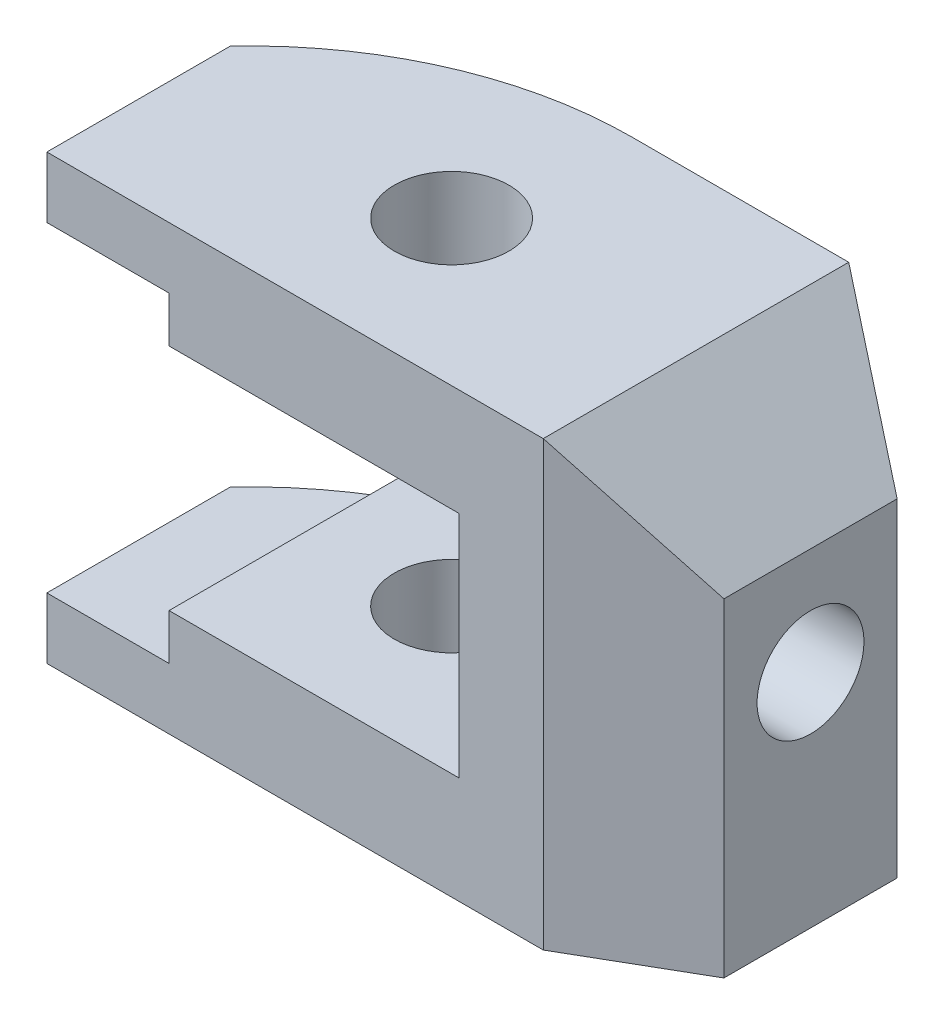
ISO-10303-21;
HEADER;
FILE_DESCRIPTION(('STEP AP214'),'2;1');
FILE_NAME('part.step','',(''),(''),'','','');
FILE_SCHEMA(('AUTOMOTIVE_DESIGN { 1 0 10303 214 1 1 1 1 }'));
ENDSEC;
DATA;
#1=APPLICATION_CONTEXT('core data for automotive mechanical design processes');
#2=APPLICATION_PROTOCOL_DEFINITION('international standard','automotive_design',2000,#1);
#3=PRODUCT_CONTEXT('',#1,'mechanical');
#4=PRODUCT('Part','Part','',(#3));
#5=PRODUCT_RELATED_PRODUCT_CATEGORY('part','',(#4));
#6=PRODUCT_DEFINITION_FORMATION('','',#4);
#7=PRODUCT_DEFINITION_CONTEXT('part definition',#1,'design');
#8=PRODUCT_DEFINITION('design','',#6,#7);
#9=PRODUCT_DEFINITION_SHAPE('','',#8);
#10=(LENGTH_UNIT() NAMED_UNIT(*) SI_UNIT(.MILLI.,.METRE.));
#11=(NAMED_UNIT(*) PLANE_ANGLE_UNIT() SI_UNIT($,.RADIAN.));
#12=(NAMED_UNIT(*) SI_UNIT($,.STERADIAN.) SOLID_ANGLE_UNIT());
#13=UNCERTAINTY_MEASURE_WITH_UNIT(LENGTH_MEASURE(1.E-05),#10,'distance_accuracy_value','');
#14=(GEOMETRIC_REPRESENTATION_CONTEXT(3) GLOBAL_UNCERTAINTY_ASSIGNED_CONTEXT((#13)) GLOBAL_UNIT_ASSIGNED_CONTEXT((#10,
#11,#12)) REPRESENTATION_CONTEXT('',''));
#15=CARTESIAN_POINT('',(0.,0.,0.));
#16=DIRECTION('',(0.,0.,1.));
#17=DIRECTION('',(1.,0.,0.));
#18=AXIS2_PLACEMENT_3D('',#15,#16,#17);
#19=CARTESIAN_POINT('',(36.6606055596467,58.,10.));
#20=DIRECTION('',(0.,-1.,0.));
#21=DIRECTION('',(0.,0.,-1.));
#22=AXIS2_PLACEMENT_3D('',#19,#20,#21);
#23=CYLINDRICAL_SURFACE('',#22,50.);
#24=DIRECTION('',(0.,-1.,0.));
#25=VECTOR('',#24,1.);
#26=CARTESIAN_POINT('',(0.,58.,-24.));
#27=LINE('',#26,#25);
#28=CARTESIAN_POINT('',(0.,8.,-24.));
#29=VERTEX_POINT('',#28);
#30=CARTESIAN_POINT('',(0.,0.,-24.));
#31=VERTEX_POINT('',#30);
#32=EDGE_CURVE('E193',#29,#31,#27,.T.);
#33=ORIENTED_EDGE('',*,*,#32,.F.);
#34=CARTESIAN_POINT('',(36.6606055596467,7.99999999999999,10.));
#35=DIRECTION('',(0.,-1.,0.));
#36=DIRECTION('',(1.,0.,0.));
#37=AXIS2_PLACEMENT_3D('',#34,#35,#36);
#38=CIRCLE('',#37,50.);
#39=CARTESIAN_POINT('',(16.,8.,-35.5317403347236));
#40=VERTEX_POINT('',#39);
#41=EDGE_CURVE('E268',#29,#40,#38,.T.);
#42=ORIENTED_EDGE('',*,*,#41,.T.);
#43=DIRECTION('',(0.,-1.,0.));
#44=VECTOR('',#43,1.);
#45=CARTESIAN_POINT('',(16.,58.,-35.5317403347236));
#46=LINE('',#45,#44);
#47=CARTESIAN_POINT('',(16.,14.,-35.5317403347236));
#48=VERTEX_POINT('',#47);
#49=EDGE_CURVE('E304',#40,#48,#46,.F.);
#50=ORIENTED_EDGE('',*,*,#49,.T.);
#51=CARTESIAN_POINT('',(36.6606055596467,14.,10.));
#52=DIRECTION('',(0.,-1.,0.));
#53=DIRECTION('',(1.,0.,0.));
#54=AXIS2_PLACEMENT_3D('',#51,#52,#53);
#55=CIRCLE('',#54,50.);
#56=CARTESIAN_POINT('',(36.6606055596467,14.,-40.));
#57=VERTEX_POINT('',#56);
#58=EDGE_CURVE('E296',#48,#57,#55,.T.);
#59=ORIENTED_EDGE('',*,*,#58,.T.);
#60=DIRECTION('',(0.,-1.,0.));
#61=VECTOR('',#60,1.);
#62=CARTESIAN_POINT('',(36.6606055596467,58.,-40.));
#63=LINE('',#62,#61);
#64=CARTESIAN_POINT('',(36.6606055596467,0.,-40.));
#65=VERTEX_POINT('',#64);
#66=EDGE_CURVE('E197',#57,#65,#63,.T.);
#67=ORIENTED_EDGE('',*,*,#66,.T.);
#68=CARTESIAN_POINT('',(36.6606055596467,0.,10.));
#69=DIRECTION('',(0.,1.,0.));
#70=DIRECTION('',(0.,0.,1.));
#71=AXIS2_PLACEMENT_3D('',#68,#69,#70);
#72=CIRCLE('',#71,50.);
#73=EDGE_CURVE('E241',#65,#31,#72,.T.);
#74=ORIENTED_EDGE('',*,*,#73,.T.);
#75=EDGE_LOOP('',(#33,#42,#50,#59,#67,#74));
#76=FACE_BOUND('',#75,.T.);
#77=ADVANCED_FACE('F41',(#76),#23,.T.);
#78=CARTESIAN_POINT('',(0.,58.,0.));
#79=DIRECTION('',(-1.,0.,0.));
#80=DIRECTION('',(0.,0.,1.));
#81=AXIS2_PLACEMENT_3D('',#78,#79,#80);
#82=PLANE('',#81);
#83=DIRECTION('',(0.,0.,-1.));
#84=VECTOR('',#83,1.);
#85=CARTESIAN_POINT('',(0.,8.,18.));
#86=LINE('',#85,#84);
#87=CARTESIAN_POINT('',(0.,8.,0.));
#88=VERTEX_POINT('',#87);
#89=EDGE_CURVE('E204',#88,#29,#86,.T.);
#90=ORIENTED_EDGE('',*,*,#89,.T.);
#91=ORIENTED_EDGE('',*,*,#32,.T.);
#92=DIRECTION('',(0.,0.,-1.));
#93=VECTOR('',#92,1.);
#94=CARTESIAN_POINT('',(0.,0.,0.));
#95=LINE('',#94,#93);
#96=CARTESIAN_POINT('',(0.,0.,0.));
#97=VERTEX_POINT('',#96);
#98=EDGE_CURVE('E236',#97,#31,#95,.T.);
#99=ORIENTED_EDGE('',*,*,#98,.F.);
#100=DIRECTION('',(0.,-1.,0.));
#101=VECTOR('',#100,1.);
#102=CARTESIAN_POINT('',(0.,58.,0.));
#103=LINE('',#102,#101);
#104=EDGE_CURVE('E185',#88,#97,#103,.T.);
#105=ORIENTED_EDGE('',*,*,#104,.F.);
#106=EDGE_LOOP('',(#90,#91,#99,#105));
#107=FACE_BOUND('',#106,.T.);
#108=ADVANCED_FACE('F233',(#107),#82,.T.);
#109=CARTESIAN_POINT('',(34.,58.,-19.));
#110=DIRECTION('',(0.,-1.,0.));
#111=DIRECTION('',(0.,0.,-1.));
#112=AXIS2_PLACEMENT_3D('',#109,#110,#111);
#113=CYLINDRICAL_SURFACE('',#112,7.5);
#114=CARTESIAN_POINT('',(34.,14.,-19.));
#115=DIRECTION('',(0.,-1.,0.));
#116=DIRECTION('',(1.,0.,0.));
#117=AXIS2_PLACEMENT_3D('',#114,#115,#116);
#118=CIRCLE('',#117,7.5);
#119=CARTESIAN_POINT('',(41.5,14.,-19.));
#120=VERTEX_POINT('',#119);
#121=EDGE_CURVE('E205',#120,#120,#118,.T.);
#122=ORIENTED_EDGE('',*,*,#121,.F.);
#123=EDGE_LOOP('',(#122));
#124=FACE_BOUND('',#123,.T.);
#125=CARTESIAN_POINT('',(34.,0.,-19.));
#126=DIRECTION('',(0.,1.,0.));
#127=DIRECTION('',(0.,0.,1.));
#128=AXIS2_PLACEMENT_3D('',#125,#126,#127);
#129=CIRCLE('',#128,7.5);
#130=CARTESIAN_POINT('',(34.,0.,-11.5));
#131=VERTEX_POINT('',#130);
#132=EDGE_CURVE('E266',#131,#131,#129,.T.);
#133=ORIENTED_EDGE('',*,*,#132,.F.);
#134=EDGE_LOOP('',(#133));
#135=FACE_BOUND('',#134,.T.);
#136=ADVANCED_FACE('F317',(#124,#135),#113,.F.);
#137=CARTESIAN_POINT('',(0.,58.,-40.));
#138=DIRECTION('',(0.,0.,-1.));
#139=DIRECTION('',(-1.,0.,0.));
#140=AXIS2_PLACEMENT_3D('',#137,#138,#139);
#141=PLANE('',#140);
#142=DIRECTION('',(-1.,0.,0.));
#143=VECTOR('',#142,1.);
#144=CARTESIAN_POINT('',(16.,14.,-40.));
#145=LINE('',#144,#143);
#146=CARTESIAN_POINT('',(54.,14.,-40.));
#147=VERTEX_POINT('',#146);
#148=EDGE_CURVE('E283',#147,#57,#145,.T.);
#149=ORIENTED_EDGE('',*,*,#148,.F.);
#150=DIRECTION('',(0.,-1.,0.));
#151=VECTOR('',#150,1.);
#152=CARTESIAN_POINT('',(54.,44.,-40.));
#153=LINE('',#152,#151);
#154=CARTESIAN_POINT('',(54.,44.,-40.));
#155=VERTEX_POINT('',#154);
#156=EDGE_CURVE('E287',#155,#147,#153,.T.);
#157=ORIENTED_EDGE('',*,*,#156,.F.);
#158=DIRECTION('',(1.,0.,0.));
#159=VECTOR('',#158,1.);
#160=CARTESIAN_POINT('',(16.,44.,-40.));
#161=LINE('',#160,#159);
#162=CARTESIAN_POINT('',(36.6606055596467,44.,-40.));
#163=VERTEX_POINT('',#162);
#164=EDGE_CURVE('E169',#163,#155,#161,.T.);
#165=ORIENTED_EDGE('',*,*,#164,.F.);
#166=CARTESIAN_POINT('',(36.6606055596467,58.,-40.));
#167=VERTEX_POINT('',#166);
#168=EDGE_CURVE('E102',#167,#163,#63,.T.);
#169=ORIENTED_EDGE('',*,*,#168,.F.);
#170=DIRECTION('',(1.,0.,0.));
#171=VECTOR('',#170,1.);
#172=CARTESIAN_POINT('',(0.,58.,-40.));
#173=LINE('',#172,#171);
#174=CARTESIAN_POINT('',(65.,58.,-40.));
#175=VERTEX_POINT('',#174);
#176=EDGE_CURVE('E311',#167,#175,#173,.T.);
#177=ORIENTED_EDGE('',*,*,#176,.T.);
#178=DIRECTION('',(0.,-1.,0.));
#179=VECTOR('',#178,1.);
#180=CARTESIAN_POINT('',(65.,58.,-40.));
#181=LINE('',#180,#179);
#182=CARTESIAN_POINT('',(65.,0.,-40.));
#183=VERTEX_POINT('',#182);
#184=EDGE_CURVE('E96',#175,#183,#181,.T.);
#185=ORIENTED_EDGE('',*,*,#184,.T.);
#186=DIRECTION('',(1.,0.,0.));
#187=VECTOR('',#186,1.);
#188=CARTESIAN_POINT('',(0.,0.,-40.));
#189=LINE('',#188,#187);
#190=EDGE_CURVE('E244',#65,#183,#189,.T.);
#191=ORIENTED_EDGE('',*,*,#190,.F.);
#192=ORIENTED_EDGE('',*,*,#66,.F.);
#193=EDGE_LOOP('',(#149,#157,#165,#169,#177,#185,#191,#192));
#194=FACE_BOUND('',#193,.T.);
#195=ADVANCED_FACE('F313',(#194),#141,.T.);
#196=ORIENTED_EDGE('',*,*,#168,.T.);
#197=CARTESIAN_POINT('',(36.6606055596467,44.,10.));
#198=DIRECTION('',(0.,1.,0.));
#199=DIRECTION('',(-1.,0.,0.));
#200=AXIS2_PLACEMENT_3D('',#197,#198,#199);
#201=CIRCLE('',#200,50.);
#202=CARTESIAN_POINT('',(16.,44.,-35.5317403347236));
#203=VERTEX_POINT('',#202);
#204=EDGE_CURVE('E209',#163,#203,#201,.T.);
#205=ORIENTED_EDGE('',*,*,#204,.T.);
#206=DIRECTION('',(0.,-1.,0.));
#207=VECTOR('',#206,1.);
#208=CARTESIAN_POINT('',(16.,58.,-35.5317403347236));
#209=LINE('',#208,#207);
#210=CARTESIAN_POINT('',(16.,50.,-35.5317403347236));
#211=VERTEX_POINT('',#210);
#212=EDGE_CURVE('E301',#203,#211,#209,.F.);
#213=ORIENTED_EDGE('',*,*,#212,.T.);
#214=CARTESIAN_POINT('',(36.6606055596467,50.,10.));
#215=DIRECTION('',(0.,1.,0.));
#216=DIRECTION('',(0.,0.,1.));
#217=AXIS2_PLACEMENT_3D('',#214,#215,#216);
#218=CIRCLE('',#217,50.);
#219=CARTESIAN_POINT('',(0.,50.,-24.));
#220=VERTEX_POINT('',#219);
#221=EDGE_CURVE('E299',#211,#220,#218,.T.);
#222=ORIENTED_EDGE('',*,*,#221,.T.);
#223=CARTESIAN_POINT('',(0.,58.,-24.));
#224=VERTEX_POINT('',#223);
#225=EDGE_CURVE('E194',#224,#220,#27,.T.);
#226=ORIENTED_EDGE('',*,*,#225,.F.);
#227=CARTESIAN_POINT('',(36.6606055596467,58.,10.));
#228=DIRECTION('',(0.,1.,0.));
#229=DIRECTION('',(0.,0.,1.));
#230=AXIS2_PLACEMENT_3D('',#227,#228,#229);
#231=CIRCLE('',#230,50.);
#232=EDGE_CURVE('E262',#167,#224,#231,.T.);
#233=ORIENTED_EDGE('',*,*,#232,.F.);
#234=EDGE_LOOP('',(#196,#205,#213,#222,#226,#233));
#235=FACE_BOUND('',#234,.T.);
#236=ADVANCED_FACE('F316',(#235),#23,.T.);
#237=DIRECTION('',(0.,0.,-1.));
#238=VECTOR('',#237,1.);
#239=CARTESIAN_POINT('',(0.,50.,18.));
#240=LINE('',#239,#238);
#241=CARTESIAN_POINT('',(0.,50.,0.));
#242=VERTEX_POINT('',#241);
#243=EDGE_CURVE('E281',#242,#220,#240,.T.);
#244=ORIENTED_EDGE('',*,*,#243,.F.);
#245=CARTESIAN_POINT('',(0.,58.,0.));
#246=VERTEX_POINT('',#245);
#247=EDGE_CURVE('E190',#246,#242,#103,.T.);
#248=ORIENTED_EDGE('',*,*,#247,.F.);
#249=DIRECTION('',(0.,0.,-1.));
#250=VECTOR('',#249,1.);
#251=CARTESIAN_POINT('',(0.,58.,0.));
#252=LINE('',#251,#250);
#253=EDGE_CURVE('E255',#246,#224,#252,.T.);
#254=ORIENTED_EDGE('',*,*,#253,.T.);
#255=ORIENTED_EDGE('',*,*,#225,.T.);
#256=EDGE_LOOP('',(#244,#248,#254,#255));
#257=FACE_BOUND('',#256,.T.);
#258=ADVANCED_FACE('F280',(#257),#82,.T.);
#259=CARTESIAN_POINT('',(0.,58.,0.));
#260=DIRECTION('',(0.,0.,-1.));
#261=DIRECTION('',(-1.,0.,0.));
#262=AXIS2_PLACEMENT_3D('',#259,#260,#261);
#263=PLANE('',#262);
#264=DIRECTION('',(0.,-1.,0.));
#265=VECTOR('',#264,1.);
#266=CARTESIAN_POINT('',(16.,58.,0.));
#267=LINE('',#266,#265);
#268=CARTESIAN_POINT('',(16.,14.,0.));
#269=VERTEX_POINT('',#268);
#270=CARTESIAN_POINT('',(16.,8.,0.));
#271=VERTEX_POINT('',#270);
#272=EDGE_CURVE('E218',#269,#271,#267,.T.);
#273=ORIENTED_EDGE('',*,*,#272,.T.);
#274=DIRECTION('',(-1.,0.,0.));
#275=VECTOR('',#274,1.);
#276=CARTESIAN_POINT('',(0.,8.,0.));
#277=LINE('',#276,#275);
#278=EDGE_CURVE('E49',#271,#88,#277,.T.);
#279=ORIENTED_EDGE('',*,*,#278,.T.);
#280=ORIENTED_EDGE('',*,*,#104,.T.);
#281=DIRECTION('',(1.,0.,0.));
#282=VECTOR('',#281,1.);
#283=CARTESIAN_POINT('',(0.,0.,0.));
#284=LINE('',#283,#282);
#285=CARTESIAN_POINT('',(65.,0.,0.));
#286=VERTEX_POINT('',#285);
#287=EDGE_CURVE('E240',#97,#286,#284,.T.);
#288=ORIENTED_EDGE('',*,*,#287,.T.);
#289=DIRECTION('',(0.,-1.,0.));
#290=VECTOR('',#289,1.);
#291=CARTESIAN_POINT('',(65.,58.,0.));
#292=LINE('',#291,#290);
#293=CARTESIAN_POINT('',(65.,58.,0.));
#294=VERTEX_POINT('',#293);
#295=EDGE_CURVE('E183',#294,#286,#292,.T.);
#296=ORIENTED_EDGE('',*,*,#295,.F.);
#297=DIRECTION('',(1.,0.,0.));
#298=VECTOR('',#297,1.);
#299=CARTESIAN_POINT('',(0.,58.,0.));
#300=LINE('',#299,#298);
#301=EDGE_CURVE('E254',#246,#294,#300,.T.);
#302=ORIENTED_EDGE('',*,*,#301,.F.);
#303=ORIENTED_EDGE('',*,*,#247,.T.);
#304=DIRECTION('',(1.,0.,0.));
#305=VECTOR('',#304,1.);
#306=CARTESIAN_POINT('',(0.,50.,0.));
#307=LINE('',#306,#305);
#308=CARTESIAN_POINT('',(16.,50.,0.));
#309=VERTEX_POINT('',#308);
#310=EDGE_CURVE('E199',#242,#309,#307,.T.);
#311=ORIENTED_EDGE('',*,*,#310,.T.);
#312=DIRECTION('',(0.,-1.,0.));
#313=VECTOR('',#312,1.);
#314=CARTESIAN_POINT('',(16.,58.,0.));
#315=LINE('',#314,#313);
#316=CARTESIAN_POINT('',(16.,44.,0.));
#317=VERTEX_POINT('',#316);
#318=EDGE_CURVE('E212',#309,#317,#315,.T.);
#319=ORIENTED_EDGE('',*,*,#318,.T.);
#320=DIRECTION('',(1.,0.,0.));
#321=VECTOR('',#320,1.);
#322=CARTESIAN_POINT('',(0.,44.,0.));
#323=LINE('',#322,#321);
#324=CARTESIAN_POINT('',(54.,44.,0.));
#325=VERTEX_POINT('',#324);
#326=EDGE_CURVE('E203',#317,#325,#323,.T.);
#327=ORIENTED_EDGE('',*,*,#326,.T.);
#328=DIRECTION('',(0.,-1.,0.));
#329=VECTOR('',#328,1.);
#330=CARTESIAN_POINT('',(54.,58.,0.));
#331=LINE('',#330,#329);
#332=CARTESIAN_POINT('',(54.,14.,0.));
#333=VERTEX_POINT('',#332);
#334=EDGE_CURVE('E215',#325,#333,#331,.T.);
#335=ORIENTED_EDGE('',*,*,#334,.T.);
#336=DIRECTION('',(-1.,0.,0.));
#337=VECTOR('',#336,1.);
#338=CARTESIAN_POINT('',(0.,14.,0.));
#339=LINE('',#338,#337);
#340=EDGE_CURVE('E208',#333,#269,#339,.T.);
#341=ORIENTED_EDGE('',*,*,#340,.T.);
#342=EDGE_LOOP('',(#273,#279,#280,#288,#296,#302,#303,#311,#319,#327,#335,#341));
#343=FACE_BOUND('',#342,.T.);
#344=ADVANCED_FACE('F223',(#343),#263,.F.);
#345=CARTESIAN_POINT('',(16.2500000000001,58.,28.1458256229943));
#346=DIRECTION('',(-0.500000000000001,0.,-0.866025403784438));
#347=DIRECTION('',(-0.866025403784438,0.,0.500000000000001));
#348=AXIS2_PLACEMENT_3D('',#345,#346,#347);
#349=PLANE('',#348);
#350=DIRECTION('',(0.,-1.,0.));
#351=VECTOR('',#350,1.);
#352=CARTESIAN_POINT('',(80.,58.,-8.66025403784441));
#353=LINE('',#352,#351);
#354=CARTESIAN_POINT('',(80.,43.0000000000002,-8.66025403784441));
#355=VERTEX_POINT('',#354);
#356=CARTESIAN_POINT('',(80.,0.,-8.66025403784441));
#357=VERTEX_POINT('',#356);
#358=EDGE_CURVE('E175',#355,#357,#353,.T.);
#359=ORIENTED_EDGE('',*,*,#358,.F.);
#360=DIRECTION('',(-0.65465367070798,0.654653670707973,0.37796447300923));
#361=VECTOR('',#360,1.);
#362=CARTESIAN_POINT('',(37.1428571428569,85.8571428571428,16.0833289274255));
#363=LINE('',#362,#361);
#364=EDGE_CURVE('E161',#355,#294,#363,.T.);
#365=ORIENTED_EDGE('',*,*,#364,.T.);
#366=ORIENTED_EDGE('',*,*,#295,.T.);
#367=DIRECTION('',(0.866025403784438,0.,-0.500000000000001));
#368=VECTOR('',#367,1.);
#369=CARTESIAN_POINT('',(16.2500000000001,0.,28.1458256229943));
#370=LINE('',#369,#368);
#371=EDGE_CURVE('E182',#286,#357,#370,.T.);
#372=ORIENTED_EDGE('',*,*,#371,.T.);
#373=EDGE_LOOP('',(#359,#365,#366,#372));
#374=FACE_BOUND('',#373,.T.);
#375=ADVANCED_FACE('F181',(#374),#349,.F.);
#376=CARTESIAN_POINT('',(80.,58.,0.));
#377=DIRECTION('',(-1.,0.,0.));
#378=DIRECTION('',(0.,0.,1.));
#379=AXIS2_PLACEMENT_3D('',#376,#377,#378);
#380=PLANE('',#379);
#381=CARTESIAN_POINT('',(80.,29.,-20.));
#382=DIRECTION('',(1.,0.,0.));
#383=DIRECTION('',(0.,0.,-1.));
#384=AXIS2_PLACEMENT_3D('',#381,#382,#383);
#385=CIRCLE('',#384,7.);
#386=CARTESIAN_POINT('',(80.,29.,-27.));
#387=VERTEX_POINT('',#386);
#388=EDGE_CURVE('E383',#387,#387,#385,.T.);
#389=ORIENTED_EDGE('',*,*,#388,.F.);
#390=EDGE_LOOP('',(#389));
#391=FACE_BOUND('',#390,.T.);
#392=DIRECTION('',(0.,-1.,0.));
#393=VECTOR('',#392,1.);
#394=CARTESIAN_POINT('',(80.,58.,-31.3397459621556));
#395=LINE('',#394,#393);
#396=CARTESIAN_POINT('',(80.,43.0000000000002,-31.3397459621556));
#397=VERTEX_POINT('',#396);
#398=CARTESIAN_POINT('',(80.,0.,-31.3397459621556));
#399=VERTEX_POINT('',#398);
#400=EDGE_CURVE('E177',#397,#399,#395,.T.);
#401=ORIENTED_EDGE('',*,*,#400,.F.);
#402=DIRECTION('',(0.,0.,-1.));
#403=VECTOR('',#402,1.);
#404=CARTESIAN_POINT('',(80.,43.0000000000002,18.));
#405=LINE('',#404,#403);
#406=EDGE_CURVE('E164',#355,#397,#405,.T.);
#407=ORIENTED_EDGE('',*,*,#406,.F.);
#408=ORIENTED_EDGE('',*,*,#358,.T.);
#409=DIRECTION('',(0.,0.,-1.));
#410=VECTOR('',#409,1.);
#411=CARTESIAN_POINT('',(80.,0.,0.));
#412=LINE('',#411,#410);
#413=EDGE_CURVE('E249',#357,#399,#412,.T.);
#414=ORIENTED_EDGE('',*,*,#413,.T.);
#415=EDGE_LOOP('',(#401,#407,#408,#414));
#416=FACE_BOUND('',#415,.T.);
#417=ADVANCED_FACE('F173',(#391,#416),#380,.F.);
#418=CARTESIAN_POINT('',(34.,44.,-19.));
#419=DIRECTION('',(0.,1.,0.));
#420=DIRECTION('',(-1.,0.,0.));
#421=AXIS2_PLACEMENT_3D('',#418,#419,#420);
#422=CIRCLE('',#421,7.5);
#423=CARTESIAN_POINT('',(26.5,44.,-19.));
#424=VERTEX_POINT('',#423);
#425=EDGE_CURVE('E200',#424,#424,#422,.T.);
#426=ORIENTED_EDGE('',*,*,#425,.F.);
#427=EDGE_LOOP('',(#426));
#428=FACE_BOUND('',#427,.T.);
#429=CARTESIAN_POINT('',(34.,58.,-19.));
#430=DIRECTION('',(0.,1.,0.));
#431=DIRECTION('',(0.,0.,1.));
#432=AXIS2_PLACEMENT_3D('',#429,#430,#431);
#433=CIRCLE('',#432,7.5);
#434=CARTESIAN_POINT('',(34.,58.,-11.5));
#435=VERTEX_POINT('',#434);
#436=EDGE_CURVE('E253',#435,#435,#433,.T.);
#437=ORIENTED_EDGE('',*,*,#436,.T.);
#438=EDGE_LOOP('',(#437));
#439=FACE_BOUND('',#438,.T.);
#440=ADVANCED_FACE('F43',(#428,#439),#113,.F.);
#441=CARTESIAN_POINT('',(33.5705080756889,58.,-58.1458256229943));
#442=DIRECTION('',(0.500000000000001,0.,-0.866025403784438));
#443=DIRECTION('',(-0.866025403784438,0.,-0.500000000000001));
#444=AXIS2_PLACEMENT_3D('',#441,#442,#443);
#445=PLANE('',#444);
#446=DIRECTION('',(-0.65465367070798,0.654653670707973,-0.37796447300923));
#447=VECTOR('',#446,1.);
#448=CARTESIAN_POINT('',(47.0402903289649,75.9597096710349,-50.3690432131397));
#449=LINE('',#448,#447);
#450=EDGE_CURVE('E64',#397,#175,#449,.T.);
#451=ORIENTED_EDGE('',*,*,#450,.F.);
#452=ORIENTED_EDGE('',*,*,#400,.T.);
#453=DIRECTION('',(0.866025403784438,0.,0.500000000000001));
#454=VECTOR('',#453,1.);
#455=CARTESIAN_POINT('',(33.5705080756889,0.,-58.1458256229943));
#456=LINE('',#455,#454);
#457=EDGE_CURVE('E251',#183,#399,#456,.T.);
#458=ORIENTED_EDGE('',*,*,#457,.F.);
#459=ORIENTED_EDGE('',*,*,#184,.F.);
#460=EDGE_LOOP('',(#451,#452,#458,#459));
#461=FACE_BOUND('',#460,.T.);
#462=ADVANCED_FACE('F273',(#461),#445,.T.);
#463=CARTESIAN_POINT('',(0.,58.,0.));
#464=DIRECTION('',(0.,1.,0.));
#465=DIRECTION('',(0.,0.,1.));
#466=AXIS2_PLACEMENT_3D('',#463,#464,#465);
#467=PLANE('',#466);
#468=DIRECTION('',(0.,0.,1.));
#469=VECTOR('',#468,1.);
#470=CARTESIAN_POINT('',(65.,58.,0.));
#471=LINE('',#470,#469);
#472=EDGE_CURVE('E11',#175,#294,#471,.T.);
#473=ORIENTED_EDGE('',*,*,#472,.F.);
#474=ORIENTED_EDGE('',*,*,#176,.F.);
#475=ORIENTED_EDGE('',*,*,#232,.T.);
#476=ORIENTED_EDGE('',*,*,#253,.F.);
#477=ORIENTED_EDGE('',*,*,#301,.T.);
#478=EDGE_LOOP('',(#473,#474,#475,#476,#477));
#479=FACE_BOUND('',#478,.T.);
#480=ORIENTED_EDGE('',*,*,#436,.F.);
#481=EDGE_LOOP('',(#480));
#482=FACE_BOUND('',#481,.T.);
#483=ADVANCED_FACE('F274',(#479,#482),#467,.T.);
#484=CARTESIAN_POINT('',(0.,0.,0.));
#485=DIRECTION('',(0.,1.,0.));
#486=DIRECTION('',(0.,0.,1.));
#487=AXIS2_PLACEMENT_3D('',#484,#485,#486);
#488=PLANE('',#487);
#489=ORIENTED_EDGE('',*,*,#132,.T.);
#490=EDGE_LOOP('',(#489));
#491=FACE_BOUND('',#490,.T.);
#492=ORIENTED_EDGE('',*,*,#190,.T.);
#493=ORIENTED_EDGE('',*,*,#457,.T.);
#494=ORIENTED_EDGE('',*,*,#413,.F.);
#495=ORIENTED_EDGE('',*,*,#371,.F.);
#496=ORIENTED_EDGE('',*,*,#287,.F.);
#497=ORIENTED_EDGE('',*,*,#98,.T.);
#498=ORIENTED_EDGE('',*,*,#73,.F.);
#499=EDGE_LOOP('',(#492,#493,#494,#495,#496,#497,#498));
#500=FACE_BOUND('',#499,.T.);
#501=ADVANCED_FACE('F270',(#491,#500),#488,.F.);
#502=CARTESIAN_POINT('',(0.,8.,18.));
#503=DIRECTION('',(0.,-1.,0.));
#504=DIRECTION('',(1.,0.,0.));
#505=AXIS2_PLACEMENT_3D('',#502,#503,#504);
#506=PLANE('',#505);
#507=ORIENTED_EDGE('',*,*,#89,.F.);
#508=ORIENTED_EDGE('',*,*,#278,.F.);
#509=DIRECTION('',(0.,0.,-1.));
#510=VECTOR('',#509,1.);
#511=CARTESIAN_POINT('',(16.,8.,18.));
#512=LINE('',#511,#510);
#513=EDGE_CURVE('E395',#271,#40,#512,.T.);
#514=ORIENTED_EDGE('',*,*,#513,.T.);
#515=ORIENTED_EDGE('',*,*,#41,.F.);
#516=EDGE_LOOP('',(#507,#508,#514,#515));
#517=FACE_BOUND('',#516,.T.);
#518=ADVANCED_FACE('F345',(#517),#506,.F.);
#519=CARTESIAN_POINT('',(16.,14.,18.));
#520=DIRECTION('',(1.,0.,0.));
#521=DIRECTION('',(0.,0.,-1.));
#522=AXIS2_PLACEMENT_3D('',#519,#520,#521);
#523=PLANE('',#522);
#524=ORIENTED_EDGE('',*,*,#513,.F.);
#525=ORIENTED_EDGE('',*,*,#272,.F.);
#526=DIRECTION('',(0.,0.,-1.));
#527=VECTOR('',#526,1.);
#528=CARTESIAN_POINT('',(16.,14.,18.));
#529=LINE('',#528,#527);
#530=EDGE_CURVE('E397',#269,#48,#529,.T.);
#531=ORIENTED_EDGE('',*,*,#530,.T.);
#532=ORIENTED_EDGE('',*,*,#49,.F.);
#533=EDGE_LOOP('',(#524,#525,#531,#532));
#534=FACE_BOUND('',#533,.T.);
#535=ADVANCED_FACE('F363',(#534),#523,.F.);
#536=CARTESIAN_POINT('',(54.,44.,18.));
#537=DIRECTION('',(1.,0.,0.));
#538=DIRECTION('',(0.,1.,0.));
#539=AXIS2_PLACEMENT_3D('',#536,#537,#538);
#540=PLANE('',#539);
#541=CARTESIAN_POINT('',(54.,29.,-20.));
#542=DIRECTION('',(1.,0.,0.));
#543=DIRECTION('',(0.,1.,0.));
#544=AXIS2_PLACEMENT_3D('',#541,#542,#543);
#545=CIRCLE('',#544,7.);
#546=CARTESIAN_POINT('',(54.,36.,-20.));
#547=VERTEX_POINT('',#546);
#548=EDGE_CURVE('E178',#547,#547,#545,.F.);
#549=ORIENTED_EDGE('',*,*,#548,.F.);
#550=EDGE_LOOP('',(#549));
#551=FACE_BOUND('',#550,.T.);
#552=DIRECTION('',(0.,0.,-1.));
#553=VECTOR('',#552,1.);
#554=CARTESIAN_POINT('',(54.,44.,18.));
#555=LINE('',#554,#553);
#556=EDGE_CURVE('E402',#325,#155,#555,.T.);
#557=ORIENTED_EDGE('',*,*,#556,.T.);
#558=ORIENTED_EDGE('',*,*,#156,.T.);
#559=DIRECTION('',(0.,0.,-1.));
#560=VECTOR('',#559,1.);
#561=CARTESIAN_POINT('',(54.,14.,18.));
#562=LINE('',#561,#560);
#563=EDGE_CURVE('E400',#333,#147,#562,.T.);
#564=ORIENTED_EDGE('',*,*,#563,.F.);
#565=ORIENTED_EDGE('',*,*,#334,.F.);
#566=EDGE_LOOP('',(#557,#558,#564,#565));
#567=FACE_BOUND('',#566,.T.);
#568=ADVANCED_FACE('F356',(#551,#567),#540,.F.);
#569=CARTESIAN_POINT('',(16.,50.,18.));
#570=DIRECTION('',(1.,0.,0.));
#571=DIRECTION('',(0.,0.,-1.));
#572=AXIS2_PLACEMENT_3D('',#569,#570,#571);
#573=PLANE('',#572);
#574=DIRECTION('',(0.,0.,-1.));
#575=VECTOR('',#574,1.);
#576=CARTESIAN_POINT('',(16.,44.,18.));
#577=LINE('',#576,#575);
#578=EDGE_CURVE('E285',#317,#203,#577,.T.);
#579=ORIENTED_EDGE('',*,*,#578,.F.);
#580=ORIENTED_EDGE('',*,*,#318,.F.);
#581=DIRECTION('',(0.,0.,-1.));
#582=VECTOR('',#581,1.);
#583=CARTESIAN_POINT('',(16.,50.,18.));
#584=LINE('',#583,#582);
#585=EDGE_CURVE('E56',#309,#211,#584,.T.);
#586=ORIENTED_EDGE('',*,*,#585,.T.);
#587=ORIENTED_EDGE('',*,*,#212,.F.);
#588=EDGE_LOOP('',(#579,#580,#586,#587));
#589=FACE_BOUND('',#588,.T.);
#590=ADVANCED_FACE('F353',(#589),#573,.F.);
#591=CARTESIAN_POINT('',(0.,50.,18.));
#592=DIRECTION('',(0.,1.,0.));
#593=DIRECTION('',(0.,0.,1.));
#594=AXIS2_PLACEMENT_3D('',#591,#592,#593);
#595=PLANE('',#594);
#596=ORIENTED_EDGE('',*,*,#585,.F.);
#597=ORIENTED_EDGE('',*,*,#310,.F.);
#598=ORIENTED_EDGE('',*,*,#243,.T.);
#599=ORIENTED_EDGE('',*,*,#221,.F.);
#600=EDGE_LOOP('',(#596,#597,#598,#599));
#601=FACE_BOUND('',#600,.T.);
#602=ADVANCED_FACE('F349',(#601),#595,.F.);
#603=CARTESIAN_POINT('',(16.,14.,18.));
#604=DIRECTION('',(0.,-1.,0.));
#605=DIRECTION('',(1.,0.,0.));
#606=AXIS2_PLACEMENT_3D('',#603,#604,#605);
#607=PLANE('',#606);
#608=ORIENTED_EDGE('',*,*,#121,.T.);
#609=EDGE_LOOP('',(#608));
#610=FACE_BOUND('',#609,.T.);
#611=ORIENTED_EDGE('',*,*,#530,.F.);
#612=ORIENTED_EDGE('',*,*,#340,.F.);
#613=ORIENTED_EDGE('',*,*,#563,.T.);
#614=ORIENTED_EDGE('',*,*,#148,.T.);
#615=ORIENTED_EDGE('',*,*,#58,.F.);
#616=EDGE_LOOP('',(#611,#612,#613,#614,#615));
#617=FACE_BOUND('',#616,.T.);
#618=ADVANCED_FACE('F352',(#610,#617),#607,.F.);
#619=CARTESIAN_POINT('',(16.,44.,18.));
#620=DIRECTION('',(0.,1.,0.));
#621=DIRECTION('',(-1.,0.,0.));
#622=AXIS2_PLACEMENT_3D('',#619,#620,#621);
#623=PLANE('',#622);
#624=ORIENTED_EDGE('',*,*,#425,.T.);
#625=EDGE_LOOP('',(#624));
#626=FACE_BOUND('',#625,.T.);
#627=ORIENTED_EDGE('',*,*,#164,.T.);
#628=ORIENTED_EDGE('',*,*,#556,.F.);
#629=ORIENTED_EDGE('',*,*,#326,.F.);
#630=ORIENTED_EDGE('',*,*,#578,.T.);
#631=ORIENTED_EDGE('',*,*,#204,.F.);
#632=EDGE_LOOP('',(#627,#628,#629,#630,#631));
#633=FACE_BOUND('',#632,.T.);
#634=ADVANCED_FACE('F358',(#626,#633),#623,.F.);
#635=CARTESIAN_POINT('',(80.,43.0000000000002,18.));
#636=DIRECTION('',(-0.707106781186544,-0.707106781186551,0.));
#637=DIRECTION('',(0.707106781186551,-0.707106781186544,0.));
#638=AXIS2_PLACEMENT_3D('',#635,#636,#637);
#639=PLANE('',#638);
#640=ORIENTED_EDGE('',*,*,#406,.T.);
#641=ORIENTED_EDGE('',*,*,#450,.T.);
#642=ORIENTED_EDGE('',*,*,#472,.T.);
#643=ORIENTED_EDGE('',*,*,#364,.F.);
#644=EDGE_LOOP('',(#640,#641,#642,#643));
#645=FACE_BOUND('',#644,.T.);
#646=ADVANCED_FACE('F163',(#645),#639,.F.);
#647=CARTESIAN_POINT('',(-0.00100000000001488,29.,-20.));
#648=DIRECTION('',(1.,0.,0.));
#649=DIRECTION('',(0.,0.,-1.));
#650=AXIS2_PLACEMENT_3D('',#647,#648,#649);
#651=CYLINDRICAL_SURFACE('',#650,7.);
#652=ORIENTED_EDGE('',*,*,#388,.T.);
#653=EDGE_LOOP('',(#652));
#654=FACE_BOUND('',#653,.T.);
#655=ORIENTED_EDGE('',*,*,#548,.T.);
#656=EDGE_LOOP('',(#655));
#657=FACE_BOUND('',#656,.T.);
#658=ADVANCED_FACE('F375',(#654,#657),#651,.F.);
#659=CLOSED_SHELL('',(#77,#108,#136,#195,#236,#258,#344,#375,#417,#440,#462,#483,#501,#518,#535,
#568,#590,#602,#618,#634,#646,#658));
#660=MANIFOLD_SOLID_BREP('B2',#659);
#661=ADVANCED_BREP_SHAPE_REPRESENTATION('',(#18,#660),#14);
#662=SHAPE_DEFINITION_REPRESENTATION(#9,#661);
ENDSEC;
END-ISO-10303-21;
